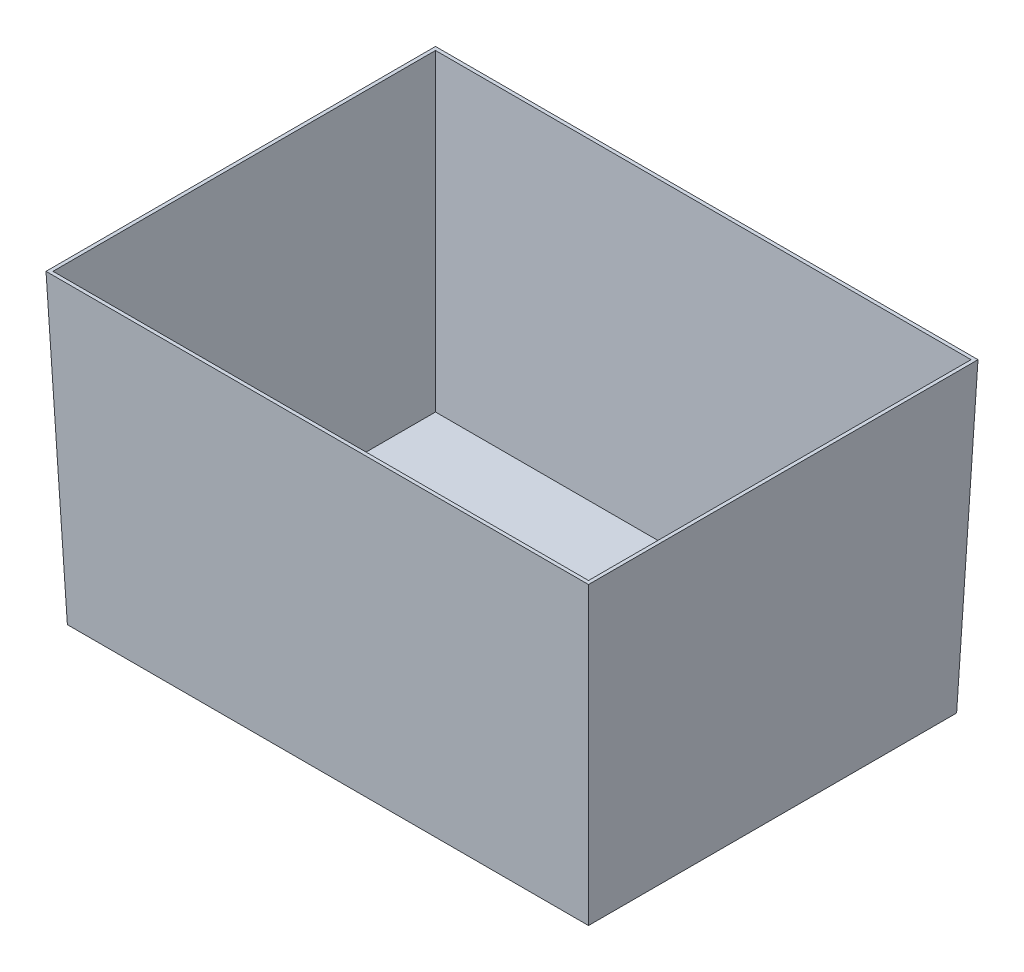
ISO-10303-21;
HEADER;
FILE_DESCRIPTION(('STEP AP214'),'2;1');
FILE_NAME('part.step','',(''),(''),'','','');
FILE_SCHEMA(('AUTOMOTIVE_DESIGN { 1 0 10303 214 1 1 1 1 }'));
ENDSEC;
DATA;
#1=APPLICATION_CONTEXT('core data for automotive mechanical design processes');
#2=APPLICATION_PROTOCOL_DEFINITION('international standard','automotive_design',2000,#1);
#3=PRODUCT_CONTEXT('',#1,'mechanical');
#4=PRODUCT('Part','Part','',(#3));
#5=PRODUCT_RELATED_PRODUCT_CATEGORY('part','',(#4));
#6=PRODUCT_DEFINITION_FORMATION('','',#4);
#7=PRODUCT_DEFINITION_CONTEXT('part definition',#1,'design');
#8=PRODUCT_DEFINITION('design','',#6,#7);
#9=PRODUCT_DEFINITION_SHAPE('','',#8);
#10=(LENGTH_UNIT() NAMED_UNIT(*) SI_UNIT(.MILLI.,.METRE.));
#11=(NAMED_UNIT(*) PLANE_ANGLE_UNIT() SI_UNIT($,.RADIAN.));
#12=(NAMED_UNIT(*) SI_UNIT($,.STERADIAN.) SOLID_ANGLE_UNIT());
#13=UNCERTAINTY_MEASURE_WITH_UNIT(LENGTH_MEASURE(1.E-05),#10,'distance_accuracy_value','');
#14=(GEOMETRIC_REPRESENTATION_CONTEXT(3) GLOBAL_UNCERTAINTY_ASSIGNED_CONTEXT((#13)) GLOBAL_UNIT_ASSIGNED_CONTEXT((#10,
#11,#12)) REPRESENTATION_CONTEXT('',''));
#15=CARTESIAN_POINT('',(0.,0.,0.));
#16=DIRECTION('',(0.,0.,1.));
#17=DIRECTION('',(1.,0.,0.));
#18=AXIS2_PLACEMENT_3D('',#15,#16,#17);
#19=CARTESIAN_POINT('',(0.,0.,0.));
#20=DIRECTION('',(0.,-1.,0.));
#21=DIRECTION('',(0.,0.,-1.));
#22=AXIS2_PLACEMENT_3D('',#19,#20,#21);
#23=PLANE('',#22);
#24=DIRECTION('',(0.,0.,-1.));
#25=VECTOR('',#24,1.);
#26=CARTESIAN_POINT('',(390.,0.,280.));
#27=LINE('',#26,#25);
#28=CARTESIAN_POINT('',(390.,0.,280.));
#29=VERTEX_POINT('',#28);
#30=CARTESIAN_POINT('',(390.,0.,-280.));
#31=VERTEX_POINT('',#30);
#32=EDGE_CURVE('E120',#29,#31,#27,.T.);
#33=ORIENTED_EDGE('',*,*,#32,.T.);
#34=DIRECTION('',(-1.,0.,0.));
#35=VECTOR('',#34,1.);
#36=CARTESIAN_POINT('',(-390.,0.,-280.));
#37=LINE('',#36,#35);
#38=CARTESIAN_POINT('',(-390.,0.,-280.));
#39=VERTEX_POINT('',#38);
#40=EDGE_CURVE('E153',#31,#39,#37,.T.);
#41=ORIENTED_EDGE('',*,*,#40,.T.);
#42=DIRECTION('',(0.,0.,1.));
#43=VECTOR('',#42,1.);
#44=CARTESIAN_POINT('',(-390.,0.,280.));
#45=LINE('',#44,#43);
#46=CARTESIAN_POINT('',(-390.,0.,280.));
#47=VERTEX_POINT('',#46);
#48=EDGE_CURVE('E156',#39,#47,#45,.T.);
#49=ORIENTED_EDGE('',*,*,#48,.T.);
#50=DIRECTION('',(1.,0.,0.));
#51=VECTOR('',#50,1.);
#52=CARTESIAN_POINT('',(-390.,0.,280.));
#53=LINE('',#52,#51);
#54=EDGE_CURVE('E158',#47,#29,#53,.T.);
#55=ORIENTED_EDGE('',*,*,#54,.T.);
#56=EDGE_LOOP('',(#33,#41,#49,#55));
#57=FACE_BOUND('',#56,.T.);
#58=DIRECTION('',(0.,0.,-1.));
#59=VECTOR('',#58,1.);
#60=CARTESIAN_POINT('',(384.996952278506,0.,280.));
#61=LINE('',#60,#59);
#62=CARTESIAN_POINT('',(384.996952278506,0.,274.996952278506));
#63=VERTEX_POINT('',#62);
#64=CARTESIAN_POINT('',(384.996952278506,0.,-274.996952278506));
#65=VERTEX_POINT('',#64);
#66=EDGE_CURVE('E144',#63,#65,#61,.T.);
#67=ORIENTED_EDGE('',*,*,#66,.F.);
#68=DIRECTION('',(1.,0.,0.));
#69=VECTOR('',#68,1.);
#70=CARTESIAN_POINT('',(-390.,0.,274.996952278506));
#71=LINE('',#70,#69);
#72=CARTESIAN_POINT('',(-384.996952278506,0.,274.996952278506));
#73=VERTEX_POINT('',#72);
#74=EDGE_CURVE('E116',#73,#63,#71,.T.);
#75=ORIENTED_EDGE('',*,*,#74,.F.);
#76=DIRECTION('',(0.,0.,1.));
#77=VECTOR('',#76,1.);
#78=CARTESIAN_POINT('',(-384.996952278506,0.,280.));
#79=LINE('',#78,#77);
#80=CARTESIAN_POINT('',(-384.996952278506,0.,-274.996952278506));
#81=VERTEX_POINT('',#80);
#82=EDGE_CURVE('E49',#81,#73,#79,.T.);
#83=ORIENTED_EDGE('',*,*,#82,.F.);
#84=DIRECTION('',(-1.,0.,0.));
#85=VECTOR('',#84,1.);
#86=CARTESIAN_POINT('',(-390.,0.,-274.996952278506));
#87=LINE('',#86,#85);
#88=EDGE_CURVE('E146',#65,#81,#87,.T.);
#89=ORIENTED_EDGE('',*,*,#88,.F.);
#90=EDGE_LOOP('',(#67,#75,#83,#89));
#91=FACE_BOUND('',#90,.T.);
#92=ADVANCED_FACE('F32',(#57,#91),#23,.F.);
#93=CARTESIAN_POINT('',(390.,0.,280.));
#94=DIRECTION('',(0.999390827019096,-0.034899496702501,0.));
#95=DIRECTION('',(0.034899496702501,0.999390827019096,0.));
#96=AXIS2_PLACEMENT_3D('',#93,#94,#95);
#97=PLANE('',#96);
#98=ORIENTED_EDGE('',*,*,#32,.F.);
#99=DIRECTION('',(0.0348782627423747,0.998782765958718,0.0348782627423747));
#100=VECTOR('',#99,1.);
#101=CARTESIAN_POINT('',(389.051135294698,-27.1719300322578,279.051135294698));
#102=LINE('',#101,#100);
#103=CARTESIAN_POINT('',(374.634861423631,-440.,264.634861423631));
#104=VERTEX_POINT('',#103);
#105=EDGE_CURVE('E11',#104,#29,#102,.T.);
#106=ORIENTED_EDGE('',*,*,#105,.F.);
#107=DIRECTION('',(0.,0.,-1.));
#108=VECTOR('',#107,1.);
#109=CARTESIAN_POINT('',(374.634861423631,-440.,280.));
#110=LINE('',#109,#108);
#111=CARTESIAN_POINT('',(374.634861423631,-440.,-264.634861423631));
#112=VERTEX_POINT('',#111);
#113=EDGE_CURVE('E160',#104,#112,#110,.T.);
#114=ORIENTED_EDGE('',*,*,#113,.T.);
#115=DIRECTION('',(0.0348782627423747,0.998782765958718,-0.0348782627423747));
#116=VECTOR('',#115,1.);
#117=CARTESIAN_POINT('',(389.318763801321,-19.5080523308518,-279.318763801321));
#118=LINE('',#117,#116);
#119=EDGE_CURVE('E72',#112,#31,#118,.T.);
#120=ORIENTED_EDGE('',*,*,#119,.T.);
#121=EDGE_LOOP('',(#98,#106,#114,#120));
#122=FACE_BOUND('',#121,.T.);
#123=ADVANCED_FACE('F174',(#122),#97,.T.);
#124=CARTESIAN_POINT('',(-390.,0.,280.));
#125=DIRECTION('',(0.,-0.034899496702501,0.999390827019096));
#126=DIRECTION('',(0.,-0.999390827019096,-0.034899496702501));
#127=AXIS2_PLACEMENT_3D('',#124,#125,#126);
#128=PLANE('',#127);
#129=ORIENTED_EDGE('',*,*,#54,.F.);
#130=DIRECTION('',(-0.0348782627423747,0.998782765958718,0.0348782627423747));
#131=VECTOR('',#130,1.);
#132=CARTESIAN_POINT('',(-390.,0.,280.));
#133=LINE('',#132,#131);
#134=CARTESIAN_POINT('',(-374.634861423631,-440.,264.634861423631));
#135=VERTEX_POINT('',#134);
#136=EDGE_CURVE('E41',#135,#47,#133,.T.);
#137=ORIENTED_EDGE('',*,*,#136,.F.);
#138=DIRECTION('',(1.,0.,0.));
#139=VECTOR('',#138,1.);
#140=CARTESIAN_POINT('',(-390.,-440.,264.634861423631));
#141=LINE('',#140,#139);
#142=EDGE_CURVE('E164',#135,#104,#141,.T.);
#143=ORIENTED_EDGE('',*,*,#142,.T.);
#144=ORIENTED_EDGE('',*,*,#105,.T.);
#145=EDGE_LOOP('',(#129,#137,#143,#144));
#146=FACE_BOUND('',#145,.T.);
#147=ADVANCED_FACE('F34',(#146),#128,.T.);
#148=CARTESIAN_POINT('',(-390.,0.,280.));
#149=DIRECTION('',(-0.999390827019096,-0.034899496702501,0.));
#150=DIRECTION('',(0.034899496702501,-0.999390827019096,0.));
#151=AXIS2_PLACEMENT_3D('',#148,#149,#150);
#152=PLANE('',#151);
#153=ORIENTED_EDGE('',*,*,#48,.F.);
#154=DIRECTION('',(-0.0348782627423747,0.998782765958718,-0.0348782627423747));
#155=VECTOR('',#154,1.);
#156=CARTESIAN_POINT('',(-390.,0.,-280.));
#157=LINE('',#156,#155);
#158=CARTESIAN_POINT('',(-374.634861423631,-440.,-264.634861423631));
#159=VERTEX_POINT('',#158);
#160=EDGE_CURVE('E163',#159,#39,#157,.T.);
#161=ORIENTED_EDGE('',*,*,#160,.F.);
#162=DIRECTION('',(0.,0.,1.));
#163=VECTOR('',#162,1.);
#164=CARTESIAN_POINT('',(-374.634861423631,-440.,280.));
#165=LINE('',#164,#163);
#166=EDGE_CURVE('E168',#159,#135,#165,.T.);
#167=ORIENTED_EDGE('',*,*,#166,.T.);
#168=ORIENTED_EDGE('',*,*,#136,.T.);
#169=EDGE_LOOP('',(#153,#161,#167,#168));
#170=FACE_BOUND('',#169,.T.);
#171=ADVANCED_FACE('F178',(#170),#152,.T.);
#172=CARTESIAN_POINT('',(-390.,0.,-280.));
#173=DIRECTION('',(0.,-0.034899496702501,-0.999390827019096));
#174=DIRECTION('',(0.,0.999390827019096,-0.034899496702501));
#175=AXIS2_PLACEMENT_3D('',#172,#173,#174);
#176=PLANE('',#175);
#177=ORIENTED_EDGE('',*,*,#40,.F.);
#178=ORIENTED_EDGE('',*,*,#119,.F.);
#179=DIRECTION('',(-1.,0.,0.));
#180=VECTOR('',#179,1.);
#181=CARTESIAN_POINT('',(-390.,-440.,-264.634861423631));
#182=LINE('',#181,#180);
#183=EDGE_CURVE('E36',#112,#159,#182,.T.);
#184=ORIENTED_EDGE('',*,*,#183,.T.);
#185=ORIENTED_EDGE('',*,*,#160,.T.);
#186=EDGE_LOOP('',(#177,#178,#184,#185));
#187=FACE_BOUND('',#186,.T.);
#188=ADVANCED_FACE('F171',(#187),#176,.T.);
#189=CARTESIAN_POINT('',(0.,-440.,0.));
#190=DIRECTION('',(0.,-1.,0.));
#191=DIRECTION('',(0.,0.,-1.));
#192=AXIS2_PLACEMENT_3D('',#189,#190,#191);
#193=PLANE('',#192);
#194=ORIENTED_EDGE('',*,*,#113,.F.);
#195=ORIENTED_EDGE('',*,*,#142,.F.);
#196=ORIENTED_EDGE('',*,*,#166,.F.);
#197=ORIENTED_EDGE('',*,*,#183,.F.);
#198=EDGE_LOOP('',(#194,#195,#196,#197));
#199=FACE_BOUND('',#198,.T.);
#200=ADVANCED_FACE('F173',(#199),#193,.T.);
#201=CARTESIAN_POINT('',(385.003045864905,0.174497483512505,280.));
#202=DIRECTION('',(0.999390827019096,-0.034899496702501,0.));
#203=DIRECTION('',(0.034899496702501,0.999390827019096,0.));
#204=AXIS2_PLACEMENT_3D('',#201,#202,#203);
#205=PLANE('',#204);
#206=ORIENTED_EDGE('',*,*,#66,.T.);
#207=DIRECTION('',(0.0348782627423747,0.998782765958718,-0.0348782627423747));
#208=VECTOR('',#207,1.);
#209=CARTESIAN_POINT('',(384.327888427012,-19.1594819138351,-274.327888427012));
#210=LINE('',#209,#208);
#211=CARTESIAN_POINT('',(369.806417549596,-435.,-259.806417549596));
#212=VERTEX_POINT('',#211);
#213=EDGE_CURVE('E126',#212,#65,#210,.T.);
#214=ORIENTED_EDGE('',*,*,#213,.F.);
#215=DIRECTION('',(0.,0.,-1.));
#216=VECTOR('',#215,1.);
#217=CARTESIAN_POINT('',(369.806417549596,-435.,280.));
#218=LINE('',#217,#216);
#219=CARTESIAN_POINT('',(369.806417549596,-435.,259.806417549596));
#220=VERTEX_POINT('',#219);
#221=EDGE_CURVE('E124',#220,#212,#218,.T.);
#222=ORIENTED_EDGE('',*,*,#221,.F.);
#223=DIRECTION('',(0.0348782627423747,0.998782765958718,0.0348782627423747));
#224=VECTOR('',#223,1.);
#225=CARTESIAN_POINT('',(384.060259920388,-26.8233596152412,274.060259920388));
#226=LINE('',#225,#224);
#227=EDGE_CURVE('E110',#220,#63,#226,.T.);
#228=ORIENTED_EDGE('',*,*,#227,.T.);
#229=EDGE_LOOP('',(#206,#214,#222,#228));
#230=FACE_BOUND('',#229,.T.);
#231=ADVANCED_FACE('F125',(#230),#205,.F.);
#232=CARTESIAN_POINT('',(-390.,0.174497483512505,275.003045864905));
#233=DIRECTION('',(0.,-0.034899496702501,0.999390827019096));
#234=DIRECTION('',(0.,-0.999390827019096,-0.034899496702501));
#235=AXIS2_PLACEMENT_3D('',#232,#233,#234);
#236=PLANE('',#235);
#237=ORIENTED_EDGE('',*,*,#74,.T.);
#238=ORIENTED_EDGE('',*,*,#227,.F.);
#239=DIRECTION('',(1.,0.,0.));
#240=VECTOR('',#239,1.);
#241=CARTESIAN_POINT('',(-390.,-435.,259.806417549596));
#242=LINE('',#241,#240);
#243=CARTESIAN_POINT('',(-369.806417549595,-435.,259.806417549596));
#244=VERTEX_POINT('',#243);
#245=EDGE_CURVE('E114',#244,#220,#242,.T.);
#246=ORIENTED_EDGE('',*,*,#245,.F.);
#247=DIRECTION('',(-0.0348782627423747,0.998782765958718,0.0348782627423747));
#248=VECTOR('',#247,1.);
#249=CARTESIAN_POINT('',(-385.00912462569,0.348570417016628,275.00912462569));
#250=LINE('',#249,#248);
#251=EDGE_CURVE('E121',#244,#73,#250,.T.);
#252=ORIENTED_EDGE('',*,*,#251,.T.);
#253=EDGE_LOOP('',(#237,#238,#246,#252));
#254=FACE_BOUND('',#253,.T.);
#255=ADVANCED_FACE('F112',(#254),#236,.F.);
#256=CARTESIAN_POINT('',(-385.003045864904,0.174497483512505,280.));
#257=DIRECTION('',(-0.999390827019096,-0.034899496702501,0.));
#258=DIRECTION('',(0.034899496702501,-0.999390827019096,0.));
#259=AXIS2_PLACEMENT_3D('',#256,#257,#258);
#260=PLANE('',#259);
#261=ORIENTED_EDGE('',*,*,#82,.T.);
#262=ORIENTED_EDGE('',*,*,#251,.F.);
#263=DIRECTION('',(0.,0.,1.));
#264=VECTOR('',#263,1.);
#265=CARTESIAN_POINT('',(-369.806417549596,-435.,280.));
#266=LINE('',#265,#264);
#267=CARTESIAN_POINT('',(-369.806417549595,-435.,-259.806417549596));
#268=VERTEX_POINT('',#267);
#269=EDGE_CURVE('E135',#268,#244,#266,.T.);
#270=ORIENTED_EDGE('',*,*,#269,.F.);
#271=DIRECTION('',(-0.0348782627423747,0.998782765958718,-0.0348782627423747));
#272=VECTOR('',#271,1.);
#273=CARTESIAN_POINT('',(-385.00912462569,0.348570417016628,-275.00912462569));
#274=LINE('',#273,#272);
#275=EDGE_CURVE('E137',#268,#81,#274,.T.);
#276=ORIENTED_EDGE('',*,*,#275,.T.);
#277=EDGE_LOOP('',(#261,#262,#270,#276));
#278=FACE_BOUND('',#277,.T.);
#279=ADVANCED_FACE('F202',(#278),#260,.F.);
#280=CARTESIAN_POINT('',(-390.,0.174497483512505,-275.003045864904));
#281=DIRECTION('',(0.,-0.034899496702501,-0.999390827019096));
#282=DIRECTION('',(0.,0.999390827019096,-0.034899496702501));
#283=AXIS2_PLACEMENT_3D('',#280,#281,#282);
#284=PLANE('',#283);
#285=ORIENTED_EDGE('',*,*,#88,.T.);
#286=ORIENTED_EDGE('',*,*,#275,.F.);
#287=DIRECTION('',(-1.,0.,0.));
#288=VECTOR('',#287,1.);
#289=CARTESIAN_POINT('',(-390.,-435.,-259.806417549596));
#290=LINE('',#289,#288);
#291=EDGE_CURVE('E130',#212,#268,#290,.T.);
#292=ORIENTED_EDGE('',*,*,#291,.F.);
#293=ORIENTED_EDGE('',*,*,#213,.T.);
#294=EDGE_LOOP('',(#285,#286,#292,#293));
#295=FACE_BOUND('',#294,.T.);
#296=ADVANCED_FACE('F207',(#295),#284,.F.);
#297=CARTESIAN_POINT('',(0.,-435.,0.));
#298=DIRECTION('',(0.,-1.,0.));
#299=DIRECTION('',(0.,0.,-1.));
#300=AXIS2_PLACEMENT_3D('',#297,#298,#299);
#301=PLANE('',#300);
#302=ORIENTED_EDGE('',*,*,#221,.T.);
#303=ORIENTED_EDGE('',*,*,#291,.T.);
#304=ORIENTED_EDGE('',*,*,#269,.T.);
#305=ORIENTED_EDGE('',*,*,#245,.T.);
#306=EDGE_LOOP('',(#302,#303,#304,#305));
#307=FACE_BOUND('',#306,.T.);
#308=ADVANCED_FACE('F133',(#307),#301,.F.);
#309=CLOSED_SHELL('',(#92,#123,#147,#171,#188,#200,#231,#255,#279,#296,#308));
#310=MANIFOLD_SOLID_BREP('B2',#309);
#311=ADVANCED_BREP_SHAPE_REPRESENTATION('',(#18,#310),#14);
#312=SHAPE_DEFINITION_REPRESENTATION(#9,#311);
ENDSEC;
END-ISO-10303-21;
